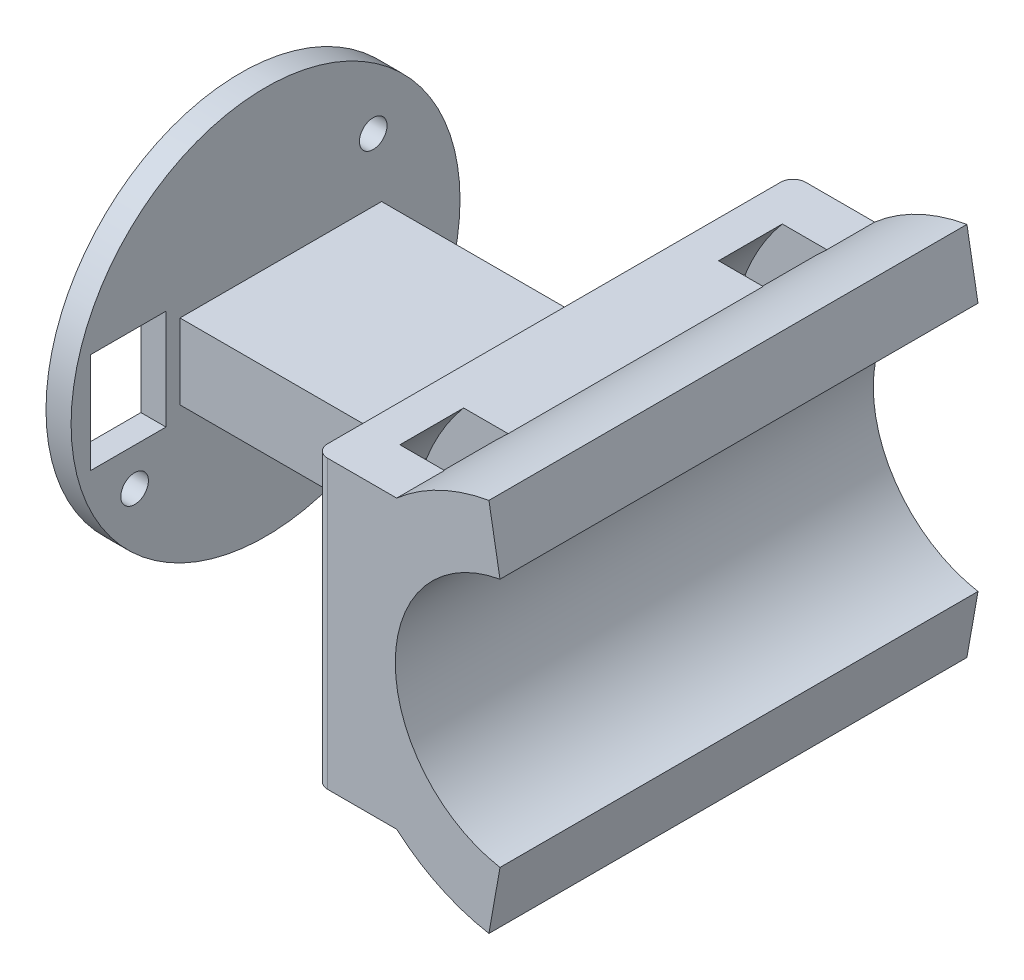
ISO-10303-21;
HEADER;
FILE_DESCRIPTION(('STEP AP214'),'2;1');
FILE_NAME('part.step','',(''),(''),'','','');
FILE_SCHEMA(('AUTOMOTIVE_DESIGN { 1 0 10303 214 1 1 1 1 }'));
ENDSEC;
DATA;
#1=APPLICATION_CONTEXT('core data for automotive mechanical design processes');
#2=APPLICATION_PROTOCOL_DEFINITION('international standard','automotive_design',2000,#1);
#3=PRODUCT_CONTEXT('',#1,'mechanical');
#4=PRODUCT('Part','Part','',(#3));
#5=PRODUCT_RELATED_PRODUCT_CATEGORY('part','',(#4));
#6=PRODUCT_DEFINITION_FORMATION('','',#4);
#7=PRODUCT_DEFINITION_CONTEXT('part definition',#1,'design');
#8=PRODUCT_DEFINITION('design','',#6,#7);
#9=PRODUCT_DEFINITION_SHAPE('','',#8);
#10=(LENGTH_UNIT() NAMED_UNIT(*) SI_UNIT(.MILLI.,.METRE.));
#11=(NAMED_UNIT(*) PLANE_ANGLE_UNIT() SI_UNIT($,.RADIAN.));
#12=(NAMED_UNIT(*) SI_UNIT($,.STERADIAN.) SOLID_ANGLE_UNIT());
#13=UNCERTAINTY_MEASURE_WITH_UNIT(LENGTH_MEASURE(1.E-05),#10,'distance_accuracy_value','');
#14=(GEOMETRIC_REPRESENTATION_CONTEXT(3) GLOBAL_UNCERTAINTY_ASSIGNED_CONTEXT((#13)) GLOBAL_UNIT_ASSIGNED_CONTEXT((#10,
#11,#12)) REPRESENTATION_CONTEXT('',''));
#15=CARTESIAN_POINT('',(0.,0.,0.));
#16=DIRECTION('',(0.,0.,1.));
#17=DIRECTION('',(1.,0.,0.));
#18=AXIS2_PLACEMENT_3D('',#15,#16,#17);
#19=CARTESIAN_POINT('',(-6.38936934946346,-11.43,19.05));
#20=DIRECTION('',(1.,0.,0.));
#21=DIRECTION('',(0.,1.,0.));
#22=AXIS2_PLACEMENT_3D('',#19,#20,#21);
#23=PLANE('',#22);
#24=DIRECTION('',(0.,0.,1.));
#25=VECTOR('',#24,1.);
#26=CARTESIAN_POINT('',(-6.38936934946345,-6.48838180573363,19.05));
#27=LINE('',#26,#25);
#28=CARTESIAN_POINT('',(-6.38936934946345,-6.48838180573363,-15.24));
#29=VERTEX_POINT('',#28);
#30=CARTESIAN_POINT('',(-6.38936934946346,-6.48838180573361,-10.16));
#31=VERTEX_POINT('',#30);
#32=EDGE_CURVE('E362',#29,#31,#27,.T.);
#33=ORIENTED_EDGE('',*,*,#32,.F.);
#34=DIRECTION('',(0.,1.,0.));
#35=VECTOR('',#34,1.);
#36=CARTESIAN_POINT('',(-6.38936934946346,-11.43,-15.24));
#37=LINE('',#36,#35);
#38=CARTESIAN_POINT('',(-6.38936934946345,6.48838180573364,-15.24));
#39=VERTEX_POINT('',#38);
#40=EDGE_CURVE('E347',#29,#39,#37,.T.);
#41=ORIENTED_EDGE('',*,*,#40,.T.);
#42=DIRECTION('',(0.,0.,1.));
#43=VECTOR('',#42,1.);
#44=CARTESIAN_POINT('',(-6.38936934946345,6.48838180573364,19.05));
#45=LINE('',#44,#43);
#46=CARTESIAN_POINT('',(-6.38936934946346,6.48838180573362,-10.16));
#47=VERTEX_POINT('',#46);
#48=EDGE_CURVE('E365',#47,#39,#45,.F.);
#49=ORIENTED_EDGE('',*,*,#48,.F.);
#50=DIRECTION('',(0.,1.,0.));
#51=VECTOR('',#50,1.);
#52=CARTESIAN_POINT('',(-6.38936934946346,-11.43,-10.16));
#53=LINE('',#52,#51);
#54=EDGE_CURVE('E339',#31,#47,#53,.T.);
#55=ORIENTED_EDGE('',*,*,#54,.F.);
#56=EDGE_LOOP('',(#33,#41,#49,#55));
#57=FACE_BOUND('',#56,.T.);
#58=DIRECTION('',(0.,-1.,0.));
#59=VECTOR('',#58,1.);
#60=CARTESIAN_POINT('',(-6.38936934946346,-3.,-9.2493893907033));
#61=LINE('',#60,#59);
#62=CARTESIAN_POINT('',(-6.38936934946346,3.,-9.2493893907033));
#63=VERTEX_POINT('',#62);
#64=CARTESIAN_POINT('',(-6.38936934946346,-3.,-9.2493893907033));
#65=VERTEX_POINT('',#64);
#66=EDGE_CURVE('E367',#63,#65,#61,.T.);
#67=ORIENTED_EDGE('',*,*,#66,.F.);
#68=DIRECTION('',(0.,0.,-1.));
#69=VECTOR('',#68,1.);
#70=CARTESIAN_POINT('',(-6.38936934946346,3.,-9.2493893907033));
#71=LINE('',#70,#69);
#72=CARTESIAN_POINT('',(-6.38936934946346,3.,6.82201027291285));
#73=VERTEX_POINT('',#72);
#74=EDGE_CURVE('E372',#73,#63,#71,.T.);
#75=ORIENTED_EDGE('',*,*,#74,.F.);
#76=DIRECTION('',(0.,1.,0.));
#77=VECTOR('',#76,1.);
#78=CARTESIAN_POINT('',(-6.38936934946346,-3.,6.82201027291285));
#79=LINE('',#78,#77);
#80=CARTESIAN_POINT('',(-6.38936934946346,-3.,6.82201027291285));
#81=VERTEX_POINT('',#80);
#82=EDGE_CURVE('E387',#81,#73,#79,.T.);
#83=ORIENTED_EDGE('',*,*,#82,.F.);
#84=DIRECTION('',(0.,0.,1.));
#85=VECTOR('',#84,1.);
#86=CARTESIAN_POINT('',(-6.38936934946346,-3.,-9.2493893907033));
#87=LINE('',#86,#85);
#88=EDGE_CURVE('E384',#65,#81,#87,.T.);
#89=ORIENTED_EDGE('',*,*,#88,.F.);
#90=EDGE_LOOP('',(#67,#75,#83,#89));
#91=FACE_BOUND('',#90,.T.);
#92=DIRECTION('',(0.,0.,-1.));
#93=VECTOR('',#92,1.);
#94=CARTESIAN_POINT('',(-6.38936934946346,11.43,19.05));
#95=LINE('',#94,#93);
#96=CARTESIAN_POINT('',(-6.38936934946346,11.43,18.05));
#97=VERTEX_POINT('',#96);
#98=CARTESIAN_POINT('',(-6.38936934946346,11.43,-18.05));
#99=VERTEX_POINT('',#98);
#100=EDGE_CURVE('E449',#97,#99,#95,.T.);
#101=ORIENTED_EDGE('',*,*,#100,.T.);
#102=DIRECTION('',(0.,-1.,0.));
#103=VECTOR('',#102,1.);
#104=CARTESIAN_POINT('',(-6.38936934946346,-11.43,-18.05));
#105=LINE('',#104,#103);
#106=CARTESIAN_POINT('',(-6.38936934946346,-11.43,-18.05));
#107=VERTEX_POINT('',#106);
#108=EDGE_CURVE('E469',#99,#107,#105,.T.);
#109=ORIENTED_EDGE('',*,*,#108,.T.);
#110=DIRECTION('',(0.,0.,-1.));
#111=VECTOR('',#110,1.);
#112=CARTESIAN_POINT('',(-6.38936934946346,-11.43,19.05));
#113=LINE('',#112,#111);
#114=CARTESIAN_POINT('',(-6.38936934946346,-11.43,18.05));
#115=VERTEX_POINT('',#114);
#116=EDGE_CURVE('E445',#115,#107,#113,.T.);
#117=ORIENTED_EDGE('',*,*,#116,.F.);
#118=DIRECTION('',(0.,-1.,0.));
#119=VECTOR('',#118,1.);
#120=CARTESIAN_POINT('',(-6.38936934946346,-11.43,18.05));
#121=LINE('',#120,#119);
#122=EDGE_CURVE('E467',#115,#97,#121,.F.);
#123=ORIENTED_EDGE('',*,*,#122,.T.);
#124=EDGE_LOOP('',(#101,#109,#117,#123));
#125=FACE_BOUND('',#124,.T.);
#126=DIRECTION('',(0.,1.,0.));
#127=VECTOR('',#126,1.);
#128=CARTESIAN_POINT('',(-6.38936934946346,-11.43,15.24));
#129=LINE('',#128,#127);
#130=CARTESIAN_POINT('',(-6.38936934946346,-6.48838180573362,15.24));
#131=VERTEX_POINT('',#130);
#132=CARTESIAN_POINT('',(-6.38936934946346,6.48838180573363,15.24));
#133=VERTEX_POINT('',#132);
#134=EDGE_CURVE('E333',#131,#133,#129,.T.);
#135=ORIENTED_EDGE('',*,*,#134,.F.);
#136=DIRECTION('',(0.,0.,1.));
#137=VECTOR('',#136,1.);
#138=CARTESIAN_POINT('',(-6.38936934946345,-6.48838180573364,19.05));
#139=LINE('',#138,#137);
#140=CARTESIAN_POINT('',(-6.38936934946346,-6.48838180573362,10.16));
#141=VERTEX_POINT('',#140);
#142=EDGE_CURVE('E353',#131,#141,#139,.F.);
#143=ORIENTED_EDGE('',*,*,#142,.T.);
#144=DIRECTION('',(0.,1.,0.));
#145=VECTOR('',#144,1.);
#146=CARTESIAN_POINT('',(-6.38936934946346,-11.43,10.16));
#147=LINE('',#146,#145);
#148=CARTESIAN_POINT('',(-6.38936934946346,6.48838180573363,10.16));
#149=VERTEX_POINT('',#148);
#150=EDGE_CURVE('E326',#141,#149,#147,.T.);
#151=ORIENTED_EDGE('',*,*,#150,.T.);
#152=DIRECTION('',(0.,0.,1.));
#153=VECTOR('',#152,1.);
#154=CARTESIAN_POINT('',(-6.38936934946345,6.48838180573365,19.05));
#155=LINE('',#154,#153);
#156=EDGE_CURVE('E356',#149,#133,#155,.T.);
#157=ORIENTED_EDGE('',*,*,#156,.T.);
#158=EDGE_LOOP('',(#135,#143,#151,#157));
#159=FACE_BOUND('',#158,.T.);
#160=ADVANCED_FACE('F43',(#57,#91,#125,#159),#23,.F.);
#161=CARTESIAN_POINT('',(0.110630650536534,11.43,19.05));
#162=DIRECTION('',(0.,-1.,0.));
#163=DIRECTION('',(1.,0.,0.));
#164=AXIS2_PLACEMENT_3D('',#161,#162,#163);
#165=PLANE('',#164);
#166=DIRECTION('',(-1.,0.,0.));
#167=VECTOR('',#166,1.);
#168=CARTESIAN_POINT('',(0.110630650536534,11.43,-19.05));
#169=LINE('',#168,#167);
#170=CARTESIAN_POINT('',(0.110630650536534,11.43,-19.05));
#171=VERTEX_POINT('',#170);
#172=CARTESIAN_POINT('',(-5.38936934946346,11.43,-19.05));
#173=VERTEX_POINT('',#172);
#174=EDGE_CURVE('E429',#171,#173,#169,.T.);
#175=ORIENTED_EDGE('',*,*,#174,.T.);
#176=CARTESIAN_POINT('',(-5.38936934946346,11.43,-18.05));
#177=DIRECTION('',(0.,-1.,0.));
#178=DIRECTION('',(1.,0.,0.));
#179=AXIS2_PLACEMENT_3D('',#176,#177,#178);
#180=CIRCLE('',#179,1.);
#181=EDGE_CURVE('E51',#173,#99,#180,.F.);
#182=ORIENTED_EDGE('',*,*,#181,.T.);
#183=ORIENTED_EDGE('',*,*,#100,.F.);
#184=CARTESIAN_POINT('',(-5.38936934946346,11.43,18.05));
#185=DIRECTION('',(0.,-1.,0.));
#186=DIRECTION('',(1.,0.,0.));
#187=AXIS2_PLACEMENT_3D('',#184,#185,#186);
#188=CIRCLE('',#187,1.);
#189=CARTESIAN_POINT('',(-5.38936934946346,11.43,19.05));
#190=VERTEX_POINT('',#189);
#191=EDGE_CURVE('E58',#97,#190,#188,.F.);
#192=ORIENTED_EDGE('',*,*,#191,.T.);
#193=DIRECTION('',(-1.,0.,0.));
#194=VECTOR('',#193,1.);
#195=CARTESIAN_POINT('',(0.110630650536534,11.43,19.05));
#196=LINE('',#195,#194);
#197=CARTESIAN_POINT('',(0.110630650536534,11.43,19.05));
#198=VERTEX_POINT('',#197);
#199=EDGE_CURVE('E412',#198,#190,#196,.T.);
#200=ORIENTED_EDGE('',*,*,#199,.F.);
#201=DIRECTION('',(0.,0.,-1.));
#202=VECTOR('',#201,1.);
#203=CARTESIAN_POINT('',(0.110630650536534,11.43,19.05));
#204=LINE('',#203,#202);
#205=CARTESIAN_POINT('',(0.110630650536528,11.43,15.24));
#206=VERTEX_POINT('',#205);
#207=EDGE_CURVE('E453',#198,#206,#204,.T.);
#208=ORIENTED_EDGE('',*,*,#207,.T.);
#209=DIRECTION('',(1.,0.,0.));
#210=VECTOR('',#209,1.);
#211=CARTESIAN_POINT('',(0.110630650536534,11.43,15.24));
#212=LINE('',#211,#210);
#213=CARTESIAN_POINT('',(-3.44080869076881,11.43,15.24));
#214=VERTEX_POINT('',#213);
#215=EDGE_CURVE('E331',#214,#206,#212,.T.);
#216=ORIENTED_EDGE('',*,*,#215,.F.);
#217=DIRECTION('',(0.,0.,1.));
#218=VECTOR('',#217,1.);
#219=CARTESIAN_POINT('',(-3.44080869076881,11.43,19.05));
#220=LINE('',#219,#218);
#221=CARTESIAN_POINT('',(-3.44080869076881,11.43,10.16));
#222=VERTEX_POINT('',#221);
#223=EDGE_CURVE('E350',#214,#222,#220,.F.);
#224=ORIENTED_EDGE('',*,*,#223,.T.);
#225=DIRECTION('',(1.,0.,0.));
#226=VECTOR('',#225,1.);
#227=CARTESIAN_POINT('',(0.110630650536534,11.43,10.16));
#228=LINE('',#227,#226);
#229=CARTESIAN_POINT('',(0.110630650536534,11.43,10.16));
#230=VERTEX_POINT('',#229);
#231=EDGE_CURVE('E323',#222,#230,#228,.T.);
#232=ORIENTED_EDGE('',*,*,#231,.T.);
#233=CARTESIAN_POINT('',(0.110630650536537,11.43,-10.16));
#234=VERTEX_POINT('',#233);
#235=EDGE_CURVE('E457',#230,#234,#204,.T.);
#236=ORIENTED_EDGE('',*,*,#235,.T.);
#237=DIRECTION('',(1.,0.,0.));
#238=VECTOR('',#237,1.);
#239=CARTESIAN_POINT('',(0.110630650536534,11.43,-10.16));
#240=LINE('',#239,#238);
#241=CARTESIAN_POINT('',(-3.44080869076881,11.43,-10.16));
#242=VERTEX_POINT('',#241);
#243=EDGE_CURVE('E337',#242,#234,#240,.T.);
#244=ORIENTED_EDGE('',*,*,#243,.F.);
#245=DIRECTION('',(0.,0.,1.));
#246=VECTOR('',#245,1.);
#247=CARTESIAN_POINT('',(-3.44080869076881,11.43,19.05));
#248=LINE('',#247,#246);
#249=CARTESIAN_POINT('',(-3.44080869076881,11.43,-15.24));
#250=VERTEX_POINT('',#249);
#251=EDGE_CURVE('E359',#250,#242,#248,.T.);
#252=ORIENTED_EDGE('',*,*,#251,.F.);
#253=DIRECTION('',(1.,0.,0.));
#254=VECTOR('',#253,1.);
#255=CARTESIAN_POINT('',(0.110630650536534,11.43,-15.24));
#256=LINE('',#255,#254);
#257=CARTESIAN_POINT('',(0.110630650536533,11.43,-15.24));
#258=VERTEX_POINT('',#257);
#259=EDGE_CURVE('E344',#250,#258,#256,.T.);
#260=ORIENTED_EDGE('',*,*,#259,.T.);
#261=EDGE_CURVE('E452',#258,#171,#204,.T.);
#262=ORIENTED_EDGE('',*,*,#261,.T.);
#263=EDGE_LOOP('',(#175,#182,#183,#192,#200,#208,#216,#224,#232,#236,#244,#252,#260,#262));
#264=FACE_BOUND('',#263,.T.);
#265=ADVANCED_FACE('F478',(#264),#165,.F.);
#266=CARTESIAN_POINT('',(0.110630650536537,-11.43,19.05));
#267=DIRECTION('',(0.,1.,0.));
#268=DIRECTION('',(-1.,0.,0.));
#269=AXIS2_PLACEMENT_3D('',#266,#267,#268);
#270=PLANE('',#269);
#271=ORIENTED_EDGE('',*,*,#116,.T.);
#272=CARTESIAN_POINT('',(-5.38936934946346,-11.43,-18.05));
#273=DIRECTION('',(0.,1.,0.));
#274=DIRECTION('',(-1.,0.,0.));
#275=AXIS2_PLACEMENT_3D('',#272,#273,#274);
#276=CIRCLE('',#275,1.);
#277=CARTESIAN_POINT('',(-5.38936934946346,-11.43,-19.05));
#278=VERTEX_POINT('',#277);
#279=EDGE_CURVE('E474',#107,#278,#276,.F.);
#280=ORIENTED_EDGE('',*,*,#279,.T.);
#281=DIRECTION('',(1.,0.,0.));
#282=VECTOR('',#281,1.);
#283=CARTESIAN_POINT('',(0.110630650536537,-11.43,-19.05));
#284=LINE('',#283,#282);
#285=CARTESIAN_POINT('',(0.11063065053654,-11.43,-19.05));
#286=VERTEX_POINT('',#285);
#287=EDGE_CURVE('E431',#278,#286,#284,.T.);
#288=ORIENTED_EDGE('',*,*,#287,.T.);
#289=DIRECTION('',(0.,0.,-1.));
#290=VECTOR('',#289,1.);
#291=CARTESIAN_POINT('',(0.11063065053654,-11.43,19.05));
#292=LINE('',#291,#290);
#293=CARTESIAN_POINT('',(0.110630650536542,-11.43,-15.24));
#294=VERTEX_POINT('',#293);
#295=EDGE_CURVE('E441',#294,#286,#292,.T.);
#296=ORIENTED_EDGE('',*,*,#295,.F.);
#297=DIRECTION('',(-1.,0.,0.));
#298=VECTOR('',#297,1.);
#299=CARTESIAN_POINT('',(0.110630650536537,-11.43,-15.24));
#300=LINE('',#299,#298);
#301=CARTESIAN_POINT('',(-3.4408086907688,-11.43,-15.24));
#302=VERTEX_POINT('',#301);
#303=EDGE_CURVE('E341',#294,#302,#300,.T.);
#304=ORIENTED_EDGE('',*,*,#303,.T.);
#305=DIRECTION('',(0.,0.,1.));
#306=VECTOR('',#305,1.);
#307=CARTESIAN_POINT('',(-3.4408086907688,-11.43,19.05));
#308=LINE('',#307,#306);
#309=CARTESIAN_POINT('',(-3.4408086907688,-11.43,-10.16));
#310=VERTEX_POINT('',#309);
#311=EDGE_CURVE('E465',#310,#302,#308,.F.);
#312=ORIENTED_EDGE('',*,*,#311,.F.);
#313=DIRECTION('',(-1.,0.,0.));
#314=VECTOR('',#313,1.);
#315=CARTESIAN_POINT('',(0.110630650536537,-11.43,-10.16));
#316=LINE('',#315,#314);
#317=CARTESIAN_POINT('',(0.11063065053654,-11.43,-10.16));
#318=VERTEX_POINT('',#317);
#319=EDGE_CURVE('E335',#318,#310,#316,.T.);
#320=ORIENTED_EDGE('',*,*,#319,.F.);
#321=CARTESIAN_POINT('',(0.11063065053654,-11.43,10.16));
#322=VERTEX_POINT('',#321);
#323=EDGE_CURVE('E446',#322,#318,#292,.T.);
#324=ORIENTED_EDGE('',*,*,#323,.F.);
#325=DIRECTION('',(-1.,0.,0.));
#326=VECTOR('',#325,1.);
#327=CARTESIAN_POINT('',(0.110630650536537,-11.43,10.16));
#328=LINE('',#327,#326);
#329=CARTESIAN_POINT('',(-3.44080869076881,-11.43,10.16));
#330=VERTEX_POINT('',#329);
#331=EDGE_CURVE('E310',#322,#330,#328,.T.);
#332=ORIENTED_EDGE('',*,*,#331,.T.);
#333=DIRECTION('',(0.,0.,1.));
#334=VECTOR('',#333,1.);
#335=CARTESIAN_POINT('',(-3.44080869076881,-11.43,19.05));
#336=LINE('',#335,#334);
#337=CARTESIAN_POINT('',(-3.44080869076881,-11.43,15.24));
#338=VERTEX_POINT('',#337);
#339=EDGE_CURVE('E462',#330,#338,#336,.T.);
#340=ORIENTED_EDGE('',*,*,#339,.T.);
#341=DIRECTION('',(-1.,0.,0.));
#342=VECTOR('',#341,1.);
#343=CARTESIAN_POINT('',(0.110630650536537,-11.43,15.24));
#344=LINE('',#343,#342);
#345=CARTESIAN_POINT('',(0.11063065053654,-11.43,15.24));
#346=VERTEX_POINT('',#345);
#347=EDGE_CURVE('E329',#346,#338,#344,.T.);
#348=ORIENTED_EDGE('',*,*,#347,.F.);
#349=CARTESIAN_POINT('',(0.11063065053654,-11.43,19.05));
#350=VERTEX_POINT('',#349);
#351=EDGE_CURVE('E442',#350,#346,#292,.T.);
#352=ORIENTED_EDGE('',*,*,#351,.F.);
#353=DIRECTION('',(1.,0.,0.));
#354=VECTOR('',#353,1.);
#355=CARTESIAN_POINT('',(0.110630650536537,-11.43,19.05));
#356=LINE('',#355,#354);
#357=CARTESIAN_POINT('',(-5.38936934946346,-11.43,19.05));
#358=VERTEX_POINT('',#357);
#359=EDGE_CURVE('E414',#358,#350,#356,.T.);
#360=ORIENTED_EDGE('',*,*,#359,.F.);
#361=CARTESIAN_POINT('',(-5.38936934946346,-11.43,18.05));
#362=DIRECTION('',(0.,1.,0.));
#363=DIRECTION('',(-1.,0.,0.));
#364=AXIS2_PLACEMENT_3D('',#361,#362,#363);
#365=CIRCLE('',#364,1.);
#366=EDGE_CURVE('E472',#358,#115,#365,.F.);
#367=ORIENTED_EDGE('',*,*,#366,.T.);
#368=EDGE_LOOP('',(#271,#280,#288,#296,#304,#312,#320,#324,#332,#340,#348,#352,#360,#367));
#369=FACE_BOUND('',#368,.T.);
#370=ADVANCED_FACE('F487',(#369),#270,.F.);
#371=CARTESIAN_POINT('',(10.1,0.,19.05));
#372=DIRECTION('',(0.,0.,-1.));
#373=DIRECTION('',(-1.,0.,0.));
#374=AXIS2_PLACEMENT_3D('',#371,#372,#373);
#375=CYLINDRICAL_SURFACE('',#374,10.1);
#376=CARTESIAN_POINT('',(10.1,0.,-19.05));
#377=DIRECTION('',(0.,0.,-1.));
#378=DIRECTION('',(-1.,0.,0.));
#379=AXIS2_PLACEMENT_3D('',#376,#377,#378);
#380=CIRCLE('',#379,10.1);
#381=CARTESIAN_POINT('',(8.34615340556399,-9.9465583054233,-19.05));
#382=VERTEX_POINT('',#381);
#383=CARTESIAN_POINT('',(8.34615340556399,9.9465583054233,-19.05));
#384=VERTEX_POINT('',#383);
#385=EDGE_CURVE('E403',#382,#384,#380,.T.);
#386=ORIENTED_EDGE('',*,*,#385,.T.);
#387=DIRECTION('',(0.,0.,-1.));
#388=VECTOR('',#387,1.);
#389=CARTESIAN_POINT('',(8.34615340556399,9.9465583054233,19.05));
#390=LINE('',#389,#388);
#391=CARTESIAN_POINT('',(8.34615340556399,9.9465583054233,19.05));
#392=VERTEX_POINT('',#391);
#393=EDGE_CURVE('E459',#392,#384,#390,.T.);
#394=ORIENTED_EDGE('',*,*,#393,.F.);
#395=CARTESIAN_POINT('',(10.1,0.,19.05));
#396=DIRECTION('',(0.,0.,-1.));
#397=DIRECTION('',(-1.,0.,0.));
#398=AXIS2_PLACEMENT_3D('',#395,#396,#397);
#399=CIRCLE('',#398,10.1);
#400=CARTESIAN_POINT('',(8.34615340556399,-9.9465583054233,19.05));
#401=VERTEX_POINT('',#400);
#402=EDGE_CURVE('E404',#401,#392,#399,.T.);
#403=ORIENTED_EDGE('',*,*,#402,.F.);
#404=DIRECTION('',(0.,0.,-1.));
#405=VECTOR('',#404,1.);
#406=CARTESIAN_POINT('',(8.34615340556399,-9.9465583054233,19.05));
#407=LINE('',#406,#405);
#408=EDGE_CURVE('E420',#401,#382,#407,.T.);
#409=ORIENTED_EDGE('',*,*,#408,.T.);
#410=EDGE_LOOP('',(#386,#394,#403,#409));
#411=FACE_BOUND('',#410,.T.);
#412=ADVANCED_FACE('F533',(#411),#375,.F.);
#413=CARTESIAN_POINT('',(8.34615340556399,9.9465583054233,19.05));
#414=DIRECTION('',(-0.984807753012208,-0.173648177666931,0.));
#415=DIRECTION('',(0.173648177666931,-0.984807753012208,0.));
#416=AXIS2_PLACEMENT_3D('',#413,#414,#415);
#417=PLANE('',#416);
#418=DIRECTION('',(-0.173648177666931,0.984807753012208,0.));
#419=VECTOR('',#418,1.);
#420=CARTESIAN_POINT('',(8.34615340556399,9.9465583054233,-19.05));
#421=LINE('',#420,#419);
#422=CARTESIAN_POINT('',(7.46402066301598,14.9493816907253,-19.05));
#423=VERTEX_POINT('',#422);
#424=EDGE_CURVE('E423',#384,#423,#421,.T.);
#425=ORIENTED_EDGE('',*,*,#424,.T.);
#426=DIRECTION('',(0.,0.,-1.));
#427=VECTOR('',#426,1.);
#428=CARTESIAN_POINT('',(7.46402066301598,14.9493816907253,19.05));
#429=LINE('',#428,#427);
#430=CARTESIAN_POINT('',(7.46402066301598,14.9493816907253,19.05));
#431=VERTEX_POINT('',#430);
#432=EDGE_CURVE('E456',#431,#423,#429,.T.);
#433=ORIENTED_EDGE('',*,*,#432,.F.);
#434=DIRECTION('',(-0.173648177666931,0.984807753012208,0.));
#435=VECTOR('',#434,1.);
#436=CARTESIAN_POINT('',(8.34615340556399,9.9465583054233,19.05));
#437=LINE('',#436,#435);
#438=EDGE_CURVE('E407',#392,#431,#437,.T.);
#439=ORIENTED_EDGE('',*,*,#438,.F.);
#440=ORIENTED_EDGE('',*,*,#393,.T.);
#441=EDGE_LOOP('',(#425,#433,#439,#440));
#442=FACE_BOUND('',#441,.T.);
#443=ADVANCED_FACE('F530',(#442),#417,.F.);
#444=CARTESIAN_POINT('',(10.1,0.,19.05));
#445=DIRECTION('',(0.,0.,-1.));
#446=DIRECTION('',(-1.,0.,0.));
#447=AXIS2_PLACEMENT_3D('',#444,#445,#446);
#448=CYLINDRICAL_SURFACE('',#447,15.18);
#449=ORIENTED_EDGE('',*,*,#432,.T.);
#450=CARTESIAN_POINT('',(10.1,0.,-19.05));
#451=DIRECTION('',(0.,0.,1.));
#452=DIRECTION('',(-1.,0.,0.));
#453=AXIS2_PLACEMENT_3D('',#450,#451,#452);
#454=CIRCLE('',#453,15.18);
#455=EDGE_CURVE('E426',#423,#171,#454,.T.);
#456=ORIENTED_EDGE('',*,*,#455,.T.);
#457=ORIENTED_EDGE('',*,*,#261,.F.);
#458=CARTESIAN_POINT('',(10.1,0.,-15.24));
#459=DIRECTION('',(0.,0.,1.));
#460=DIRECTION('',(1.,0.,0.));
#461=AXIS2_PLACEMENT_3D('',#458,#459,#460);
#462=CIRCLE('',#461,15.18);
#463=EDGE_CURVE('E307',#258,#294,#462,.T.);
#464=ORIENTED_EDGE('',*,*,#463,.T.);
#465=ORIENTED_EDGE('',*,*,#295,.T.);
#466=CARTESIAN_POINT('',(10.1,0.,-19.05));
#467=DIRECTION('',(0.,0.,1.));
#468=DIRECTION('',(-1.,0.,0.));
#469=AXIS2_PLACEMENT_3D('',#466,#467,#468);
#470=CIRCLE('',#469,15.18);
#471=CARTESIAN_POINT('',(7.46402066301598,-14.9493816907253,-19.05));
#472=VERTEX_POINT('',#471);
#473=EDGE_CURVE('E433',#286,#472,#470,.T.);
#474=ORIENTED_EDGE('',*,*,#473,.T.);
#475=DIRECTION('',(0.,0.,-1.));
#476=VECTOR('',#475,1.);
#477=CARTESIAN_POINT('',(7.46402066301598,-14.9493816907253,19.05));
#478=LINE('',#477,#476);
#479=CARTESIAN_POINT('',(7.46402066301598,-14.9493816907253,19.05));
#480=VERTEX_POINT('',#479);
#481=EDGE_CURVE('E439',#480,#472,#478,.T.);
#482=ORIENTED_EDGE('',*,*,#481,.F.);
#483=CARTESIAN_POINT('',(10.1,0.,19.05));
#484=DIRECTION('',(0.,0.,1.));
#485=DIRECTION('',(-1.,0.,0.));
#486=AXIS2_PLACEMENT_3D('',#483,#484,#485);
#487=CIRCLE('',#486,15.18);
#488=EDGE_CURVE('E416',#350,#480,#487,.T.);
#489=ORIENTED_EDGE('',*,*,#488,.F.);
#490=ORIENTED_EDGE('',*,*,#351,.T.);
#491=CARTESIAN_POINT('',(10.1,0.,15.24));
#492=DIRECTION('',(0.,0.,1.));
#493=DIRECTION('',(1.,0.,0.));
#494=AXIS2_PLACEMENT_3D('',#491,#492,#493);
#495=CIRCLE('',#494,15.18);
#496=EDGE_CURVE('E316',#206,#346,#495,.T.);
#497=ORIENTED_EDGE('',*,*,#496,.F.);
#498=ORIENTED_EDGE('',*,*,#207,.F.);
#499=CARTESIAN_POINT('',(10.1,0.,19.05));
#500=DIRECTION('',(0.,0.,1.));
#501=DIRECTION('',(-1.,0.,0.));
#502=AXIS2_PLACEMENT_3D('',#499,#500,#501);
#503=CIRCLE('',#502,15.18);
#504=EDGE_CURVE('E410',#431,#198,#503,.T.);
#505=ORIENTED_EDGE('',*,*,#504,.F.);
#506=EDGE_LOOP('',(#449,#456,#457,#464,#465,#474,#482,#489,#490,#497,#498,#505));
#507=FACE_BOUND('',#506,.T.);
#508=CARTESIAN_POINT('',(10.1,0.,-10.16));
#509=DIRECTION('',(0.,0.,1.));
#510=DIRECTION('',(1.,0.,0.));
#511=AXIS2_PLACEMENT_3D('',#508,#509,#510);
#512=CIRCLE('',#511,15.18);
#513=EDGE_CURVE('E296',#234,#318,#512,.T.);
#514=ORIENTED_EDGE('',*,*,#513,.F.);
#515=ORIENTED_EDGE('',*,*,#235,.F.);
#516=CARTESIAN_POINT('',(10.1,0.,10.16));
#517=DIRECTION('',(0.,0.,1.));
#518=DIRECTION('',(1.,0.,0.));
#519=AXIS2_PLACEMENT_3D('',#516,#517,#518);
#520=CIRCLE('',#519,15.18);
#521=EDGE_CURVE('E313',#230,#322,#520,.T.);
#522=ORIENTED_EDGE('',*,*,#521,.T.);
#523=ORIENTED_EDGE('',*,*,#323,.T.);
#524=EDGE_LOOP('',(#514,#515,#522,#523));
#525=FACE_BOUND('',#524,.T.);
#526=ADVANCED_FACE('F496',(#507,#525),#448,.T.);
#527=CARTESIAN_POINT('',(8.34615340556399,-9.9465583054233,19.05));
#528=DIRECTION('',(-0.984807753012208,0.173648177666931,0.));
#529=DIRECTION('',(-0.173648177666931,-0.984807753012208,0.));
#530=AXIS2_PLACEMENT_3D('',#527,#528,#529);
#531=PLANE('',#530);
#532=DIRECTION('',(0.173648177666931,0.984807753012208,0.));
#533=VECTOR('',#532,1.);
#534=CARTESIAN_POINT('',(8.34615340556399,-9.9465583054233,-19.05));
#535=LINE('',#534,#533);
#536=EDGE_CURVE('E408',#472,#382,#535,.T.);
#537=ORIENTED_EDGE('',*,*,#536,.T.);
#538=ORIENTED_EDGE('',*,*,#408,.F.);
#539=DIRECTION('',(0.173648177666931,0.984807753012208,0.));
#540=VECTOR('',#539,1.);
#541=CARTESIAN_POINT('',(8.34615340556399,-9.9465583054233,19.05));
#542=LINE('',#541,#540);
#543=EDGE_CURVE('E418',#480,#401,#542,.T.);
#544=ORIENTED_EDGE('',*,*,#543,.F.);
#545=ORIENTED_EDGE('',*,*,#481,.T.);
#546=EDGE_LOOP('',(#537,#538,#544,#545));
#547=FACE_BOUND('',#546,.T.);
#548=ADVANCED_FACE('F536',(#547),#531,.F.);
#549=CARTESIAN_POINT('',(10.1,0.,19.05));
#550=DIRECTION('',(0.,0.,-1.));
#551=DIRECTION('',(-1.,0.,0.));
#552=AXIS2_PLACEMENT_3D('',#549,#550,#551);
#553=PLANE('',#552);
#554=ORIENTED_EDGE('',*,*,#199,.T.);
#555=DIRECTION('',(0.,-1.,0.));
#556=VECTOR('',#555,1.);
#557=CARTESIAN_POINT('',(-5.38936934946346,0.,19.05));
#558=LINE('',#557,#556);
#559=EDGE_CURVE('E11',#190,#358,#558,.T.);
#560=ORIENTED_EDGE('',*,*,#559,.T.);
#561=ORIENTED_EDGE('',*,*,#359,.T.);
#562=ORIENTED_EDGE('',*,*,#488,.T.);
#563=ORIENTED_EDGE('',*,*,#543,.T.);
#564=ORIENTED_EDGE('',*,*,#402,.T.);
#565=ORIENTED_EDGE('',*,*,#438,.T.);
#566=ORIENTED_EDGE('',*,*,#504,.T.);
#567=EDGE_LOOP('',(#554,#560,#561,#562,#563,#564,#565,#566));
#568=FACE_BOUND('',#567,.T.);
#569=ADVANCED_FACE('F538',(#568),#553,.F.);
#570=CARTESIAN_POINT('',(10.1,0.,-19.05));
#571=DIRECTION('',(0.,0.,-1.));
#572=DIRECTION('',(-1.,0.,0.));
#573=AXIS2_PLACEMENT_3D('',#570,#571,#572);
#574=PLANE('',#573);
#575=ORIENTED_EDGE('',*,*,#287,.F.);
#576=DIRECTION('',(0.,-1.,0.));
#577=VECTOR('',#576,1.);
#578=CARTESIAN_POINT('',(-5.38936934946346,11.43,-19.05));
#579=LINE('',#578,#577);
#580=EDGE_CURVE('E66',#278,#173,#579,.F.);
#581=ORIENTED_EDGE('',*,*,#580,.T.);
#582=ORIENTED_EDGE('',*,*,#174,.F.);
#583=ORIENTED_EDGE('',*,*,#455,.F.);
#584=ORIENTED_EDGE('',*,*,#424,.F.);
#585=ORIENTED_EDGE('',*,*,#385,.F.);
#586=ORIENTED_EDGE('',*,*,#536,.F.);
#587=ORIENTED_EDGE('',*,*,#473,.F.);
#588=EDGE_LOOP('',(#575,#581,#582,#583,#584,#585,#586,#587));
#589=FACE_BOUND('',#588,.T.);
#590=ADVANCED_FACE('F491',(#589),#574,.T.);
#591=CARTESIAN_POINT('',(-29.3893693494635,-3.,-9.2493893907033));
#592=DIRECTION('',(0.,0.,1.));
#593=DIRECTION('',(1.,0.,0.));
#594=AXIS2_PLACEMENT_3D('',#591,#592,#593);
#595=PLANE('',#594);
#596=ORIENTED_EDGE('',*,*,#66,.T.);
#597=DIRECTION('',(1.,0.,0.));
#598=VECTOR('',#597,1.);
#599=CARTESIAN_POINT('',(-29.3893693494635,-3.,-9.2493893907033));
#600=LINE('',#599,#598);
#601=CARTESIAN_POINT('',(-29.3893693494635,-3.,-9.2493893907033));
#602=VERTEX_POINT('',#601);
#603=EDGE_CURVE('E400',#602,#65,#600,.T.);
#604=ORIENTED_EDGE('',*,*,#603,.F.);
#605=DIRECTION('',(0.,-1.,0.));
#606=VECTOR('',#605,1.);
#607=CARTESIAN_POINT('',(-29.3893693494635,-3.,-9.2493893907033));
#608=LINE('',#607,#606);
#609=CARTESIAN_POINT('',(-29.3893693494635,3.,-9.2493893907033));
#610=VERTEX_POINT('',#609);
#611=EDGE_CURVE('E368',#610,#602,#608,.T.);
#612=ORIENTED_EDGE('',*,*,#611,.F.);
#613=DIRECTION('',(1.,0.,0.));
#614=VECTOR('',#613,1.);
#615=CARTESIAN_POINT('',(-29.3893693494635,3.,-9.2493893907033));
#616=LINE('',#615,#614);
#617=EDGE_CURVE('E381',#610,#63,#616,.T.);
#618=ORIENTED_EDGE('',*,*,#617,.T.);
#619=EDGE_LOOP('',(#596,#604,#612,#618));
#620=FACE_BOUND('',#619,.T.);
#621=ADVANCED_FACE('F600',(#620),#595,.F.);
#622=CARTESIAN_POINT('',(-29.3893693494635,-3.,-9.2493893907033));
#623=DIRECTION('',(0.,1.,0.));
#624=DIRECTION('',(0.,0.,1.));
#625=AXIS2_PLACEMENT_3D('',#622,#623,#624);
#626=PLANE('',#625);
#627=ORIENTED_EDGE('',*,*,#88,.T.);
#628=DIRECTION('',(1.,0.,0.));
#629=VECTOR('',#628,1.);
#630=CARTESIAN_POINT('',(-29.3893693494635,-3.,6.82201027291285));
#631=LINE('',#630,#629);
#632=CARTESIAN_POINT('',(-29.3893693494635,-3.,6.82201027291285));
#633=VERTEX_POINT('',#632);
#634=EDGE_CURVE('E397',#633,#81,#631,.T.);
#635=ORIENTED_EDGE('',*,*,#634,.F.);
#636=DIRECTION('',(0.,0.,1.));
#637=VECTOR('',#636,1.);
#638=CARTESIAN_POINT('',(-29.3893693494635,-3.,-9.2493893907033));
#639=LINE('',#638,#637);
#640=EDGE_CURVE('E371',#602,#633,#639,.T.);
#641=ORIENTED_EDGE('',*,*,#640,.F.);
#642=ORIENTED_EDGE('',*,*,#603,.T.);
#643=EDGE_LOOP('',(#627,#635,#641,#642));
#644=FACE_BOUND('',#643,.T.);
#645=ADVANCED_FACE('F718',(#644),#626,.F.);
#646=CARTESIAN_POINT('',(-29.3893693494635,-3.,6.82201027291285));
#647=DIRECTION('',(0.,0.,-1.));
#648=DIRECTION('',(-1.,0.,0.));
#649=AXIS2_PLACEMENT_3D('',#646,#647,#648);
#650=PLANE('',#649);
#651=ORIENTED_EDGE('',*,*,#82,.T.);
#652=DIRECTION('',(1.,0.,0.));
#653=VECTOR('',#652,1.);
#654=CARTESIAN_POINT('',(-29.3893693494635,3.,6.82201027291285));
#655=LINE('',#654,#653);
#656=CARTESIAN_POINT('',(-29.3893693494635,3.,6.82201027291285));
#657=VERTEX_POINT('',#656);
#658=EDGE_CURVE('E394',#657,#73,#655,.T.);
#659=ORIENTED_EDGE('',*,*,#658,.F.);
#660=DIRECTION('',(0.,1.,0.));
#661=VECTOR('',#660,1.);
#662=CARTESIAN_POINT('',(-29.3893693494635,-3.,6.82201027291285));
#663=LINE('',#662,#661);
#664=EDGE_CURVE('E375',#633,#657,#663,.T.);
#665=ORIENTED_EDGE('',*,*,#664,.F.);
#666=ORIENTED_EDGE('',*,*,#634,.T.);
#667=EDGE_LOOP('',(#651,#659,#665,#666));
#668=FACE_BOUND('',#667,.T.);
#669=ADVANCED_FACE('F727',(#668),#650,.F.);
#670=CARTESIAN_POINT('',(-29.3893693494635,3.,-9.2493893907033));
#671=DIRECTION('',(0.,-1.,0.));
#672=DIRECTION('',(0.,0.,-1.));
#673=AXIS2_PLACEMENT_3D('',#670,#671,#672);
#674=PLANE('',#673);
#675=ORIENTED_EDGE('',*,*,#74,.T.);
#676=ORIENTED_EDGE('',*,*,#617,.F.);
#677=DIRECTION('',(0.,0.,-1.));
#678=VECTOR('',#677,1.);
#679=CARTESIAN_POINT('',(-29.3893693494635,3.,-9.2493893907033));
#680=LINE('',#679,#678);
#681=EDGE_CURVE('E378',#657,#610,#680,.T.);
#682=ORIENTED_EDGE('',*,*,#681,.F.);
#683=ORIENTED_EDGE('',*,*,#658,.T.);
#684=EDGE_LOOP('',(#675,#676,#682,#683));
#685=FACE_BOUND('',#684,.T.);
#686=ADVANCED_FACE('F735',(#685),#674,.F.);
#687=CARTESIAN_POINT('',(10.1,0.,19.05));
#688=DIRECTION('',(0.,0.,1.));
#689=DIRECTION('',(1.,0.,0.));
#690=AXIS2_PLACEMENT_3D('',#687,#688,#689);
#691=CYLINDRICAL_SURFACE('',#690,17.72);
#692=CARTESIAN_POINT('',(10.1,0.,10.16));
#693=DIRECTION('',(0.,0.,1.));
#694=DIRECTION('',(1.,0.,0.));
#695=AXIS2_PLACEMENT_3D('',#692,#693,#694);
#696=CIRCLE('',#695,17.72);
#697=EDGE_CURVE('E311',#222,#149,#696,.T.);
#698=ORIENTED_EDGE('',*,*,#697,.F.);
#699=ORIENTED_EDGE('',*,*,#223,.F.);
#700=CARTESIAN_POINT('',(10.1,0.,15.24));
#701=DIRECTION('',(0.,0.,1.));
#702=DIRECTION('',(1.,0.,0.));
#703=AXIS2_PLACEMENT_3D('',#700,#701,#702);
#704=CIRCLE('',#703,17.72);
#705=EDGE_CURVE('E299',#214,#133,#704,.T.);
#706=ORIENTED_EDGE('',*,*,#705,.T.);
#707=ORIENTED_EDGE('',*,*,#156,.F.);
#708=EDGE_LOOP('',(#698,#699,#706,#707));
#709=FACE_BOUND('',#708,.T.);
#710=ADVANCED_FACE('F558',(#709),#691,.F.);
#711=EDGE_CURVE('E318',#131,#338,#704,.T.);
#712=ORIENTED_EDGE('',*,*,#711,.T.);
#713=ORIENTED_EDGE('',*,*,#339,.F.);
#714=EDGE_CURVE('E293',#141,#330,#696,.T.);
#715=ORIENTED_EDGE('',*,*,#714,.F.);
#716=ORIENTED_EDGE('',*,*,#142,.F.);
#717=EDGE_LOOP('',(#712,#713,#715,#716));
#718=FACE_BOUND('',#717,.T.);
#719=ADVANCED_FACE('F551',(#718),#691,.F.);
#720=CARTESIAN_POINT('',(0.,0.,15.24));
#721=DIRECTION('',(0.,0.,-1.));
#722=DIRECTION('',(-1.,0.,0.));
#723=AXIS2_PLACEMENT_3D('',#720,#721,#722);
#724=PLANE('',#723);
#725=ORIENTED_EDGE('',*,*,#134,.T.);
#726=ORIENTED_EDGE('',*,*,#705,.F.);
#727=ORIENTED_EDGE('',*,*,#215,.T.);
#728=ORIENTED_EDGE('',*,*,#496,.T.);
#729=ORIENTED_EDGE('',*,*,#347,.T.);
#730=ORIENTED_EDGE('',*,*,#711,.F.);
#731=EDGE_LOOP('',(#725,#726,#727,#728,#729,#730));
#732=FACE_BOUND('',#731,.T.);
#733=ADVANCED_FACE('F548',(#732),#724,.T.);
#734=CARTESIAN_POINT('',(0.,0.,10.16));
#735=DIRECTION('',(0.,0.,-1.));
#736=DIRECTION('',(-1.,0.,0.));
#737=AXIS2_PLACEMENT_3D('',#734,#735,#736);
#738=PLANE('',#737);
#739=ORIENTED_EDGE('',*,*,#714,.T.);
#740=ORIENTED_EDGE('',*,*,#331,.F.);
#741=ORIENTED_EDGE('',*,*,#521,.F.);
#742=ORIENTED_EDGE('',*,*,#231,.F.);
#743=ORIENTED_EDGE('',*,*,#697,.T.);
#744=ORIENTED_EDGE('',*,*,#150,.F.);
#745=EDGE_LOOP('',(#739,#740,#741,#742,#743,#744));
#746=FACE_BOUND('',#745,.T.);
#747=ADVANCED_FACE('F796',(#746),#738,.F.);
#748=CARTESIAN_POINT('',(10.1,0.,19.05));
#749=DIRECTION('',(0.,0.,1.));
#750=DIRECTION('',(1.,0.,0.));
#751=AXIS2_PLACEMENT_3D('',#748,#749,#750);
#752=CYLINDRICAL_SURFACE('',#751,17.72);
#753=ORIENTED_EDGE('',*,*,#48,.T.);
#754=CARTESIAN_POINT('',(10.1,0.,-15.24));
#755=DIRECTION('',(0.,0.,1.));
#756=DIRECTION('',(1.,0.,0.));
#757=AXIS2_PLACEMENT_3D('',#754,#755,#756);
#758=CIRCLE('',#757,17.72);
#759=EDGE_CURVE('E304',#250,#39,#758,.T.);
#760=ORIENTED_EDGE('',*,*,#759,.F.);
#761=ORIENTED_EDGE('',*,*,#251,.T.);
#762=CARTESIAN_POINT('',(10.1,0.,-10.16));
#763=DIRECTION('',(0.,0.,1.));
#764=DIRECTION('',(1.,0.,0.));
#765=AXIS2_PLACEMENT_3D('',#762,#763,#764);
#766=CIRCLE('',#765,17.72);
#767=EDGE_CURVE('E300',#242,#47,#766,.T.);
#768=ORIENTED_EDGE('',*,*,#767,.T.);
#769=EDGE_LOOP('',(#753,#760,#761,#768));
#770=FACE_BOUND('',#769,.T.);
#771=ADVANCED_FACE('F521',(#770),#752,.F.);
#772=ORIENTED_EDGE('',*,*,#32,.T.);
#773=EDGE_CURVE('E298',#31,#310,#766,.T.);
#774=ORIENTED_EDGE('',*,*,#773,.T.);
#775=ORIENTED_EDGE('',*,*,#311,.T.);
#776=EDGE_CURVE('E303',#29,#302,#758,.T.);
#777=ORIENTED_EDGE('',*,*,#776,.F.);
#778=EDGE_LOOP('',(#772,#774,#775,#777));
#779=FACE_BOUND('',#778,.T.);
#780=ADVANCED_FACE('F512',(#779),#752,.F.);
#781=CARTESIAN_POINT('',(0.,0.,-15.24));
#782=DIRECTION('',(0.,0.,-1.));
#783=DIRECTION('',(-1.,0.,0.));
#784=AXIS2_PLACEMENT_3D('',#781,#782,#783);
#785=PLANE('',#784);
#786=ORIENTED_EDGE('',*,*,#776,.T.);
#787=ORIENTED_EDGE('',*,*,#303,.F.);
#788=ORIENTED_EDGE('',*,*,#463,.F.);
#789=ORIENTED_EDGE('',*,*,#259,.F.);
#790=ORIENTED_EDGE('',*,*,#759,.T.);
#791=ORIENTED_EDGE('',*,*,#40,.F.);
#792=EDGE_LOOP('',(#786,#787,#788,#789,#790,#791));
#793=FACE_BOUND('',#792,.T.);
#794=ADVANCED_FACE('F706',(#793),#785,.F.);
#795=CARTESIAN_POINT('',(0.,0.,-10.16));
#796=DIRECTION('',(0.,0.,-1.));
#797=DIRECTION('',(-1.,0.,0.));
#798=AXIS2_PLACEMENT_3D('',#795,#796,#797);
#799=PLANE('',#798);
#800=ORIENTED_EDGE('',*,*,#54,.T.);
#801=ORIENTED_EDGE('',*,*,#767,.F.);
#802=ORIENTED_EDGE('',*,*,#243,.T.);
#803=ORIENTED_EDGE('',*,*,#513,.T.);
#804=ORIENTED_EDGE('',*,*,#319,.T.);
#805=ORIENTED_EDGE('',*,*,#773,.F.);
#806=EDGE_LOOP('',(#800,#801,#802,#803,#804,#805));
#807=FACE_BOUND('',#806,.T.);
#808=ADVANCED_FACE('F510',(#807),#799,.T.);
#809=CARTESIAN_POINT('',(-29.3893693494635,0.,0.));
#810=DIRECTION('',(-1.,0.,0.));
#811=DIRECTION('',(0.,0.,1.));
#812=AXIS2_PLACEMENT_3D('',#809,#810,#811);
#813=PLANE('',#812);
#814=CARTESIAN_POINT('',(-29.3893693494635,0.,0.));
#815=DIRECTION('',(-1.,0.,0.));
#816=DIRECTION('',(0.,0.,1.));
#817=AXIS2_PLACEMENT_3D('',#814,#815,#816);
#818=CIRCLE('',#817,15.5);
#819=CARTESIAN_POINT('',(-29.3893693494635,0.,15.5));
#820=VERTEX_POINT('',#819);
#821=EDGE_CURVE('E263',#820,#820,#818,.T.);
#822=ORIENTED_EDGE('',*,*,#821,.F.);
#823=EDGE_LOOP('',(#822));
#824=FACE_BOUND('',#823,.T.);
#825=DIRECTION('',(0.,0.,-1.));
#826=VECTOR('',#825,1.);
#827=CARTESIAN_POINT('',(-29.3893693494635,4.02571564197786,13.9361823695232));
#828=LINE('',#827,#826);
#829=CARTESIAN_POINT('',(-29.3893693494635,4.02571564197786,13.9361823695232));
#830=VERTEX_POINT('',#829);
#831=CARTESIAN_POINT('',(-29.3893693494635,4.02571564197786,7.93618236952319));
#832=VERTEX_POINT('',#831);
#833=EDGE_CURVE('E277',#830,#832,#828,.T.);
#834=ORIENTED_EDGE('',*,*,#833,.T.);
#835=DIRECTION('',(0.,-1.,0.));
#836=VECTOR('',#835,1.);
#837=CARTESIAN_POINT('',(-29.3893693494635,4.02571564197786,7.93618236952319));
#838=LINE('',#837,#836);
#839=CARTESIAN_POINT('',(-29.3893693494635,-3.97428435802213,7.93618236952319));
#840=VERTEX_POINT('',#839);
#841=EDGE_CURVE('E262',#832,#840,#838,.T.);
#842=ORIENTED_EDGE('',*,*,#841,.T.);
#843=DIRECTION('',(0.,0.,1.));
#844=VECTOR('',#843,1.);
#845=CARTESIAN_POINT('',(-29.3893693494635,-3.97428435802213,13.9361823695232));
#846=LINE('',#845,#844);
#847=CARTESIAN_POINT('',(-29.3893693494635,-3.97428435802213,13.9361823695232));
#848=VERTEX_POINT('',#847);
#849=EDGE_CURVE('E281',#840,#848,#846,.T.);
#850=ORIENTED_EDGE('',*,*,#849,.T.);
#851=DIRECTION('',(0.,1.,0.));
#852=VECTOR('',#851,1.);
#853=CARTESIAN_POINT('',(-29.3893693494635,4.02571564197786,13.9361823695232));
#854=LINE('',#853,#852);
#855=EDGE_CURVE('E256',#848,#830,#854,.T.);
#856=ORIENTED_EDGE('',*,*,#855,.T.);
#857=EDGE_LOOP('',(#834,#842,#850,#856));
#858=FACE_BOUND('',#857,.T.);
#859=CARTESIAN_POINT('',(-29.3893693494635,-6.97426488049745,10.4359727372306));
#860=DIRECTION('',(-1.,0.,0.));
#861=DIRECTION('',(0.,0.,1.));
#862=AXIS2_PLACEMENT_3D('',#859,#860,#861);
#863=CIRCLE('',#862,1.09996238605737);
#864=CARTESIAN_POINT('',(-29.3893693494635,-6.97426488049745,11.535935123288));
#865=VERTEX_POINT('',#864);
#866=EDGE_CURVE('E864',#865,#865,#863,.T.);
#867=ORIENTED_EDGE('',*,*,#866,.T.);
#868=EDGE_LOOP('',(#867));
#869=FACE_BOUND('',#868,.T.);
#870=CARTESIAN_POINT('',(-29.3893693494635,8.02573511950256,-8.58094871473817));
#871=DIRECTION('',(-1.,0.,0.));
#872=DIRECTION('',(0.,0.,1.));
#873=AXIS2_PLACEMENT_3D('',#870,#871,#872);
#874=CIRCLE('',#873,1.0993224);
#875=CARTESIAN_POINT('',(-29.3893693494635,8.02573511950256,-7.48162631473817));
#876=VERTEX_POINT('',#875);
#877=EDGE_CURVE('E867',#876,#876,#874,.T.);
#878=ORIENTED_EDGE('',*,*,#877,.T.);
#879=EDGE_LOOP('',(#878));
#880=FACE_BOUND('',#879,.T.);
#881=ORIENTED_EDGE('',*,*,#681,.T.);
#882=ORIENTED_EDGE('',*,*,#611,.T.);
#883=ORIENTED_EDGE('',*,*,#640,.T.);
#884=ORIENTED_EDGE('',*,*,#664,.T.);
#885=EDGE_LOOP('',(#881,#882,#883,#884));
#886=FACE_BOUND('',#885,.T.);
#887=ADVANCED_FACE('F686',(#824,#858,#869,#880,#886),#813,.F.);
#888=CARTESIAN_POINT('',(-31.3893693494635,0.,0.));
#889=DIRECTION('',(-1.,0.,0.));
#890=DIRECTION('',(0.,0.,1.));
#891=AXIS2_PLACEMENT_3D('',#888,#889,#890);
#892=PLANE('',#891);
#893=CARTESIAN_POINT('',(-31.3893693494635,-6.97426488049745,10.4359727372306));
#894=DIRECTION('',(-1.,0.,0.));
#895=DIRECTION('',(0.,0.,1.));
#896=AXIS2_PLACEMENT_3D('',#893,#894,#895);
#897=CIRCLE('',#896,1.09996238605737);
#898=CARTESIAN_POINT('',(-31.3893693494635,-6.97426488049745,11.535935123288));
#899=VERTEX_POINT('',#898);
#900=EDGE_CURVE('E279',#899,#899,#897,.T.);
#901=ORIENTED_EDGE('',*,*,#900,.F.);
#902=EDGE_LOOP('',(#901));
#903=FACE_BOUND('',#902,.T.);
#904=CARTESIAN_POINT('',(-31.3893693494635,0.,0.));
#905=DIRECTION('',(-1.,0.,0.));
#906=DIRECTION('',(0.,0.,1.));
#907=AXIS2_PLACEMENT_3D('',#904,#905,#906);
#908=CIRCLE('',#907,15.5);
#909=CARTESIAN_POINT('',(-31.3893693494635,0.,15.5));
#910=VERTEX_POINT('',#909);
#911=EDGE_CURVE('E290',#910,#910,#908,.T.);
#912=ORIENTED_EDGE('',*,*,#911,.T.);
#913=EDGE_LOOP('',(#912));
#914=FACE_BOUND('',#913,.T.);
#915=DIRECTION('',(0.,-1.,0.));
#916=VECTOR('',#915,1.);
#917=CARTESIAN_POINT('',(-31.3893693494635,4.02571564197786,7.93618236952319));
#918=LINE('',#917,#916);
#919=CARTESIAN_POINT('',(-31.3893693494635,4.02571564197786,7.93618236952319));
#920=VERTEX_POINT('',#919);
#921=CARTESIAN_POINT('',(-31.3893693494635,-3.97428435802213,7.93618236952319));
#922=VERTEX_POINT('',#921);
#923=EDGE_CURVE('E255',#920,#922,#918,.T.);
#924=ORIENTED_EDGE('',*,*,#923,.F.);
#925=DIRECTION('',(0.,0.,-1.));
#926=VECTOR('',#925,1.);
#927=CARTESIAN_POINT('',(-31.3893693494635,4.02571564197786,13.9361823695232));
#928=LINE('',#927,#926);
#929=CARTESIAN_POINT('',(-31.3893693494635,4.02571564197786,13.9361823695232));
#930=VERTEX_POINT('',#929);
#931=EDGE_CURVE('E245',#930,#920,#928,.T.);
#932=ORIENTED_EDGE('',*,*,#931,.F.);
#933=DIRECTION('',(0.,1.,0.));
#934=VECTOR('',#933,1.);
#935=CARTESIAN_POINT('',(-31.3893693494635,4.02571564197786,13.9361823695232));
#936=LINE('',#935,#934);
#937=CARTESIAN_POINT('',(-31.3893693494635,-3.97428435802213,13.9361823695232));
#938=VERTEX_POINT('',#937);
#939=EDGE_CURVE('E272',#938,#930,#936,.T.);
#940=ORIENTED_EDGE('',*,*,#939,.F.);
#941=DIRECTION('',(0.,0.,1.));
#942=VECTOR('',#941,1.);
#943=CARTESIAN_POINT('',(-31.3893693494635,-3.97428435802213,13.9361823695232));
#944=LINE('',#943,#942);
#945=EDGE_CURVE('E270',#922,#938,#944,.T.);
#946=ORIENTED_EDGE('',*,*,#945,.F.);
#947=EDGE_LOOP('',(#924,#932,#940,#946));
#948=FACE_BOUND('',#947,.T.);
#949=CARTESIAN_POINT('',(-31.3893693494635,8.02573511950256,-8.58094871473817));
#950=DIRECTION('',(-1.,0.,0.));
#951=DIRECTION('',(0.,0.,1.));
#952=AXIS2_PLACEMENT_3D('',#949,#950,#951);
#953=CIRCLE('',#952,1.0993224);
#954=CARTESIAN_POINT('',(-31.3893693494635,8.02573511950256,-7.48162631473817));
#955=VERTEX_POINT('',#954);
#956=EDGE_CURVE('E869',#955,#955,#953,.T.);
#957=ORIENTED_EDGE('',*,*,#956,.F.);
#958=EDGE_LOOP('',(#957));
#959=FACE_BOUND('',#958,.T.);
#960=ADVANCED_FACE('F267',(#903,#914,#948,#959),#892,.T.);
#961=CARTESIAN_POINT('',(-31.3893693494635,0.,0.));
#962=DIRECTION('',(1.,0.,0.));
#963=DIRECTION('',(0.,0.,-1.));
#964=AXIS2_PLACEMENT_3D('',#961,#962,#963);
#965=CYLINDRICAL_SURFACE('',#964,15.5);
#966=ORIENTED_EDGE('',*,*,#911,.F.);
#967=EDGE_LOOP('',(#966));
#968=FACE_BOUND('',#967,.T.);
#969=ORIENTED_EDGE('',*,*,#821,.T.);
#970=EDGE_LOOP('',(#969));
#971=FACE_BOUND('',#970,.T.);
#972=ADVANCED_FACE('F668',(#968,#971),#965,.T.);
#973=CARTESIAN_POINT('',(-31.3893693494635,4.02571564197786,13.9361823695232));
#974=DIRECTION('',(0.,-1.,0.));
#975=DIRECTION('',(0.,0.,-1.));
#976=AXIS2_PLACEMENT_3D('',#973,#974,#975);
#977=PLANE('',#976);
#978=ORIENTED_EDGE('',*,*,#833,.F.);
#979=DIRECTION('',(1.,0.,0.));
#980=VECTOR('',#979,1.);
#981=CARTESIAN_POINT('',(-31.3893693494635,4.02571564197786,13.9361823695232));
#982=LINE('',#981,#980);
#983=EDGE_CURVE('E251',#930,#830,#982,.T.);
#984=ORIENTED_EDGE('',*,*,#983,.F.);
#985=ORIENTED_EDGE('',*,*,#931,.T.);
#986=DIRECTION('',(1.,0.,0.));
#987=VECTOR('',#986,1.);
#988=CARTESIAN_POINT('',(-31.3893693494635,4.02571564197786,7.93618236952319));
#989=LINE('',#988,#987);
#990=EDGE_CURVE('E248',#920,#832,#989,.T.);
#991=ORIENTED_EDGE('',*,*,#990,.T.);
#992=EDGE_LOOP('',(#978,#984,#985,#991));
#993=FACE_BOUND('',#992,.T.);
#994=ADVANCED_FACE('F247',(#993),#977,.T.);
#995=CARTESIAN_POINT('',(-31.3893693494635,4.02571564197786,7.93618236952319));
#996=DIRECTION('',(0.,0.,1.));
#997=DIRECTION('',(1.,0.,0.));
#998=AXIS2_PLACEMENT_3D('',#995,#996,#997);
#999=PLANE('',#998);
#1000=ORIENTED_EDGE('',*,*,#841,.F.);
#1001=ORIENTED_EDGE('',*,*,#990,.F.);
#1002=ORIENTED_EDGE('',*,*,#923,.T.);
#1003=DIRECTION('',(1.,0.,0.));
#1004=VECTOR('',#1003,1.);
#1005=CARTESIAN_POINT('',(-31.3893693494635,-3.97428435802213,7.93618236952319));
#1006=LINE('',#1005,#1004);
#1007=EDGE_CURVE('E264',#922,#840,#1006,.T.);
#1008=ORIENTED_EDGE('',*,*,#1007,.T.);
#1009=EDGE_LOOP('',(#1000,#1001,#1002,#1008));
#1010=FACE_BOUND('',#1009,.T.);
#1011=ADVANCED_FACE('F259',(#1010),#999,.T.);
#1012=CARTESIAN_POINT('',(-31.3893693494635,-3.97428435802213,13.9361823695232));
#1013=DIRECTION('',(0.,1.,0.));
#1014=DIRECTION('',(0.,0.,1.));
#1015=AXIS2_PLACEMENT_3D('',#1012,#1013,#1014);
#1016=PLANE('',#1015);
#1017=ORIENTED_EDGE('',*,*,#849,.F.);
#1018=ORIENTED_EDGE('',*,*,#1007,.F.);
#1019=ORIENTED_EDGE('',*,*,#945,.T.);
#1020=DIRECTION('',(1.,0.,0.));
#1021=VECTOR('',#1020,1.);
#1022=CARTESIAN_POINT('',(-31.3893693494635,-3.97428435802213,13.9361823695232));
#1023=LINE('',#1022,#1021);
#1024=EDGE_CURVE('E287',#938,#848,#1023,.T.);
#1025=ORIENTED_EDGE('',*,*,#1024,.T.);
#1026=EDGE_LOOP('',(#1017,#1018,#1019,#1025));
#1027=FACE_BOUND('',#1026,.T.);
#1028=ADVANCED_FACE('F641',(#1027),#1016,.T.);
#1029=CARTESIAN_POINT('',(-31.3893693494635,4.02571564197786,13.9361823695232));
#1030=DIRECTION('',(0.,0.,-1.));
#1031=DIRECTION('',(-1.,0.,0.));
#1032=AXIS2_PLACEMENT_3D('',#1029,#1030,#1031);
#1033=PLANE('',#1032);
#1034=ORIENTED_EDGE('',*,*,#855,.F.);
#1035=ORIENTED_EDGE('',*,*,#1024,.F.);
#1036=ORIENTED_EDGE('',*,*,#939,.T.);
#1037=ORIENTED_EDGE('',*,*,#983,.T.);
#1038=EDGE_LOOP('',(#1034,#1035,#1036,#1037));
#1039=FACE_BOUND('',#1038,.T.);
#1040=ADVANCED_FACE('F631',(#1039),#1033,.T.);
#1041=CARTESIAN_POINT('',(-31.3893693494635,-6.97426488049745,10.4359727372306));
#1042=DIRECTION('',(1.,0.,0.));
#1043=DIRECTION('',(0.,0.,-1.));
#1044=AXIS2_PLACEMENT_3D('',#1041,#1042,#1043);
#1045=CYLINDRICAL_SURFACE('',#1044,1.09996238605737);
#1046=ORIENTED_EDGE('',*,*,#900,.T.);
#1047=EDGE_LOOP('',(#1046));
#1048=FACE_BOUND('',#1047,.T.);
#1049=ORIENTED_EDGE('',*,*,#866,.F.);
#1050=EDGE_LOOP('',(#1049));
#1051=FACE_BOUND('',#1050,.T.);
#1052=ADVANCED_FACE('F621',(#1048,#1051),#1045,.F.);
#1053=CARTESIAN_POINT('',(-31.3893693494635,8.02573511950256,-8.58094871473817));
#1054=DIRECTION('',(1.,0.,0.));
#1055=DIRECTION('',(0.,0.,-1.));
#1056=AXIS2_PLACEMENT_3D('',#1053,#1054,#1055);
#1057=CYLINDRICAL_SURFACE('',#1056,1.0993224);
#1058=ORIENTED_EDGE('',*,*,#956,.T.);
#1059=EDGE_LOOP('',(#1058));
#1060=FACE_BOUND('',#1059,.T.);
#1061=ORIENTED_EDGE('',*,*,#877,.F.);
#1062=EDGE_LOOP('',(#1061));
#1063=FACE_BOUND('',#1062,.T.);
#1064=ADVANCED_FACE('F565',(#1060,#1063),#1057,.F.);
#1065=CARTESIAN_POINT('',(-5.38936934946346,-11.43,-18.05));
#1066=DIRECTION('',(0.,1.,0.));
#1067=DIRECTION('',(-1.,0.,0.));
#1068=AXIS2_PLACEMENT_3D('',#1065,#1066,#1067);
#1069=CYLINDRICAL_SURFACE('',#1068,1.);
#1070=ORIENTED_EDGE('',*,*,#181,.F.);
#1071=ORIENTED_EDGE('',*,*,#580,.F.);
#1072=ORIENTED_EDGE('',*,*,#279,.F.);
#1073=ORIENTED_EDGE('',*,*,#108,.F.);
#1074=EDGE_LOOP('',(#1070,#1071,#1072,#1073));
#1075=FACE_BOUND('',#1074,.T.);
#1076=ADVANCED_FACE('F485',(#1075),#1069,.T.);
#1077=CARTESIAN_POINT('',(-5.38936934946346,0.,18.05));
#1078=DIRECTION('',(0.,-1.,0.));
#1079=DIRECTION('',(1.,0.,0.));
#1080=AXIS2_PLACEMENT_3D('',#1077,#1078,#1079);
#1081=CYLINDRICAL_SURFACE('',#1080,1.);
#1082=ORIENTED_EDGE('',*,*,#191,.F.);
#1083=ORIENTED_EDGE('',*,*,#122,.F.);
#1084=ORIENTED_EDGE('',*,*,#366,.F.);
#1085=ORIENTED_EDGE('',*,*,#559,.F.);
#1086=EDGE_LOOP('',(#1082,#1083,#1084,#1085));
#1087=FACE_BOUND('',#1086,.T.);
#1088=ADVANCED_FACE('F45',(#1087),#1081,.T.);
#1089=CLOSED_SHELL('',(#160,#265,#370,#412,#443,#526,#548,#569,#590,#621,#645,#669,#686,#710,
#719,#733,#747,#771,#780,#794,#808,#887,#960,#972,#994,#1011,#1028,#1040,#1052,#1064,#1076,#1088));
#1090=MANIFOLD_SOLID_BREP('B2',#1089);
#1091=ADVANCED_BREP_SHAPE_REPRESENTATION('',(#18,#1090),#14);
#1092=SHAPE_DEFINITION_REPRESENTATION(#9,#1091);
ENDSEC;
END-ISO-10303-21;
